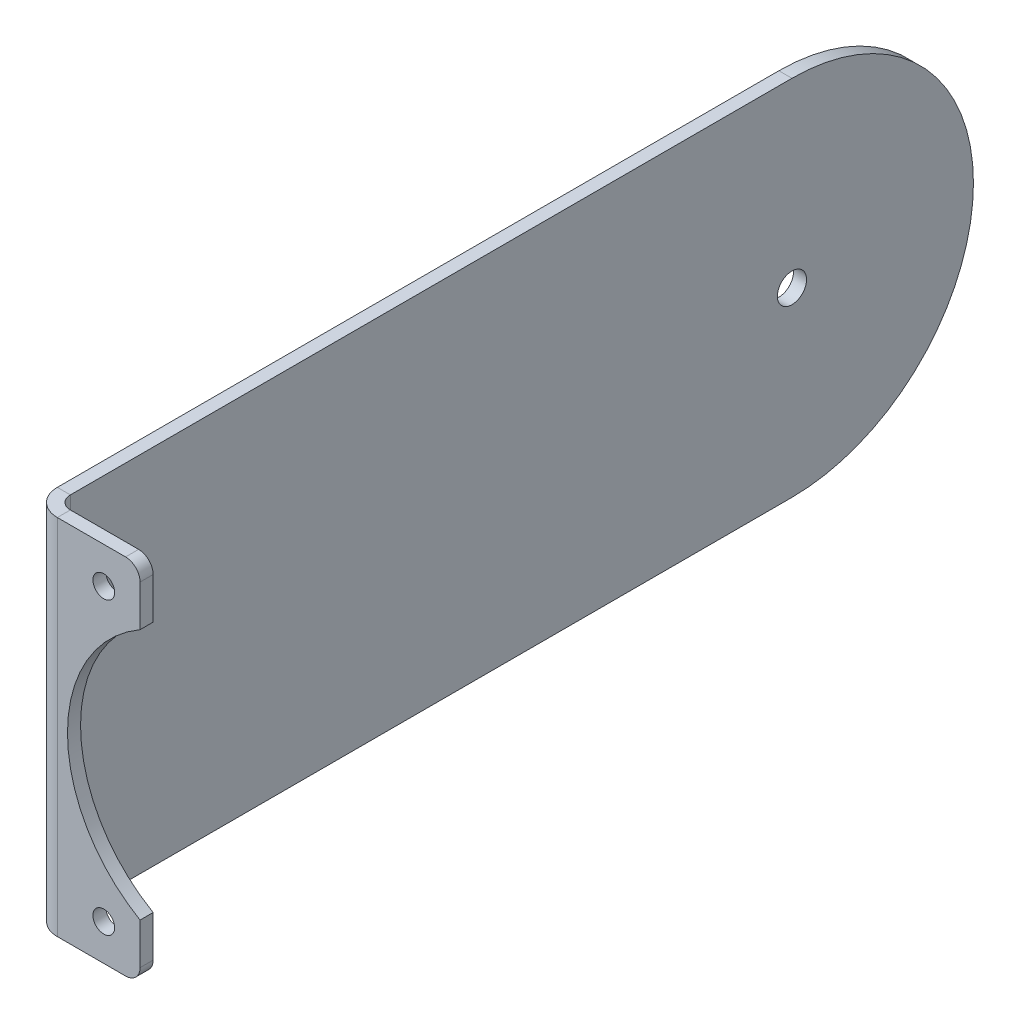
ISO-10303-21;
HEADER;
FILE_DESCRIPTION(('STEP AP214'),'2;1');
FILE_NAME('part.step','',(''),(''),'','','');
FILE_SCHEMA(('AUTOMOTIVE_DESIGN { 1 0 10303 214 1 1 1 1 }'));
ENDSEC;
DATA;
#1=APPLICATION_CONTEXT('core data for automotive mechanical design processes');
#2=APPLICATION_PROTOCOL_DEFINITION('international standard','automotive_design',2000,#1);
#3=PRODUCT_CONTEXT('',#1,'mechanical');
#4=PRODUCT('Part','Part','',(#3));
#5=PRODUCT_RELATED_PRODUCT_CATEGORY('part','',(#4));
#6=PRODUCT_DEFINITION_FORMATION('','',#4);
#7=PRODUCT_DEFINITION_CONTEXT('part definition',#1,'design');
#8=PRODUCT_DEFINITION('design','',#6,#7);
#9=PRODUCT_DEFINITION_SHAPE('','',#8);
#10=(LENGTH_UNIT() NAMED_UNIT(*) SI_UNIT(.MILLI.,.METRE.));
#11=(NAMED_UNIT(*) PLANE_ANGLE_UNIT() SI_UNIT($,.RADIAN.));
#12=(NAMED_UNIT(*) SI_UNIT($,.STERADIAN.) SOLID_ANGLE_UNIT());
#13=UNCERTAINTY_MEASURE_WITH_UNIT(LENGTH_MEASURE(1.E-05),#10,'distance_accuracy_value','');
#14=(GEOMETRIC_REPRESENTATION_CONTEXT(3) GLOBAL_UNCERTAINTY_ASSIGNED_CONTEXT((#13)) GLOBAL_UNIT_ASSIGNED_CONTEXT((#10,
#11,#12)) REPRESENTATION_CONTEXT('',''));
#15=CARTESIAN_POINT('',(0.,0.,0.));
#16=DIRECTION('',(0.,0.,1.));
#17=DIRECTION('',(1.,0.,0.));
#18=AXIS2_PLACEMENT_3D('',#15,#16,#17);
#19=CARTESIAN_POINT('',(-7.23900000000002,31.75,-81.28));
#20=DIRECTION('',(1.,0.,0.));
#21=DIRECTION('',(0.,0.,-1.));
#22=AXIS2_PLACEMENT_3D('',#19,#20,#21);
#23=PLANE('',#22);
#24=CARTESIAN_POINT('',(-7.23900000000001,0.,-49.53));
#25=DIRECTION('',(1.,0.,0.));
#26=DIRECTION('',(0.,0.,-1.));
#27=AXIS2_PLACEMENT_3D('',#24,#25,#26);
#28=CIRCLE('',#27,2.5527);
#29=CARTESIAN_POINT('',(-7.23900000000001,0.,-52.0827));
#30=VERTEX_POINT('',#29);
#31=EDGE_CURVE('E153',#30,#30,#28,.T.);
#32=ORIENTED_EDGE('',*,*,#31,.F.);
#33=EDGE_LOOP('',(#32));
#34=FACE_BOUND('',#33,.T.);
#35=DIRECTION('',(0.,0.,1.));
#36=VECTOR('',#35,1.);
#37=CARTESIAN_POINT('',(-7.23900000000002,-31.75,-81.28));
#38=LINE('',#37,#36);
#39=CARTESIAN_POINT('',(-7.23900000000001,-31.75,-49.53));
#40=VERTEX_POINT('',#39);
#41=CARTESIAN_POINT('',(-7.23900000000001,-31.75,76.708));
#42=VERTEX_POINT('',#41);
#43=EDGE_CURVE('E160',#40,#42,#38,.T.);
#44=ORIENTED_EDGE('',*,*,#43,.F.);
#45=CARTESIAN_POINT('',(-7.23900000000001,0.,-49.53));
#46=DIRECTION('',(1.,0.,0.));
#47=DIRECTION('',(0.,0.,-1.));
#48=AXIS2_PLACEMENT_3D('',#45,#46,#47);
#49=CIRCLE('',#48,31.75);
#50=CARTESIAN_POINT('',(-7.23900000000001,31.75,-49.53));
#51=VERTEX_POINT('',#50);
#52=EDGE_CURVE('E66',#51,#40,#49,.F.);
#53=ORIENTED_EDGE('',*,*,#52,.F.);
#54=DIRECTION('',(0.,0.,1.));
#55=VECTOR('',#54,1.);
#56=CARTESIAN_POINT('',(-7.23900000000002,31.75,-81.28));
#57=LINE('',#56,#55);
#58=CARTESIAN_POINT('',(-7.23900000000001,31.75,76.708));
#59=VERTEX_POINT('',#58);
#60=EDGE_CURVE('E265',#51,#59,#57,.T.);
#61=ORIENTED_EDGE('',*,*,#60,.T.);
#62=DIRECTION('',(0.,-1.,0.));
#63=VECTOR('',#62,1.);
#64=CARTESIAN_POINT('',(-7.23900000000001,31.75,76.708));
#65=LINE('',#64,#63);
#66=EDGE_CURVE('E175',#59,#42,#65,.T.);
#67=ORIENTED_EDGE('',*,*,#66,.T.);
#68=EDGE_LOOP('',(#44,#53,#61,#67));
#69=FACE_BOUND('',#68,.T.);
#70=ADVANCED_FACE('F50',(#34,#69),#23,.T.);
#71=CARTESIAN_POINT('',(-9.52500000000002,31.75,-81.28));
#72=DIRECTION('',(1.,0.,0.));
#73=DIRECTION('',(0.,0.,-1.));
#74=AXIS2_PLACEMENT_3D('',#71,#72,#73);
#75=PLANE('',#74);
#76=CARTESIAN_POINT('',(-9.52500000000001,0.,-49.53));
#77=DIRECTION('',(-1.,0.,0.));
#78=DIRECTION('',(0.,0.,1.));
#79=AXIS2_PLACEMENT_3D('',#76,#77,#78);
#80=CIRCLE('',#79,2.5527);
#81=CARTESIAN_POINT('',(-9.52500000000001,0.,-46.9773));
#82=VERTEX_POINT('',#81);
#83=EDGE_CURVE('E294',#82,#82,#80,.T.);
#84=ORIENTED_EDGE('',*,*,#83,.F.);
#85=EDGE_LOOP('',(#84));
#86=FACE_BOUND('',#85,.T.);
#87=DIRECTION('',(0.,0.,1.));
#88=VECTOR('',#87,1.);
#89=CARTESIAN_POINT('',(-9.52500000000002,31.75,-81.28));
#90=LINE('',#89,#88);
#91=CARTESIAN_POINT('',(-9.52500000000001,31.75,-49.53));
#92=VERTEX_POINT('',#91);
#93=CARTESIAN_POINT('',(-9.52500000000001,31.75,76.708));
#94=VERTEX_POINT('',#93);
#95=EDGE_CURVE('E151',#92,#94,#90,.T.);
#96=ORIENTED_EDGE('',*,*,#95,.F.);
#97=CARTESIAN_POINT('',(-9.52500000000001,0.,-49.53));
#98=DIRECTION('',(1.,0.,0.));
#99=DIRECTION('',(0.,0.,1.));
#100=AXIS2_PLACEMENT_3D('',#97,#98,#99);
#101=CIRCLE('',#100,31.75);
#102=CARTESIAN_POINT('',(-9.52500000000001,-31.75,-49.53));
#103=VERTEX_POINT('',#102);
#104=EDGE_CURVE('E140',#103,#92,#101,.T.);
#105=ORIENTED_EDGE('',*,*,#104,.F.);
#106=DIRECTION('',(0.,0.,1.));
#107=VECTOR('',#106,1.);
#108=CARTESIAN_POINT('',(-9.52500000000002,-31.75,-81.28));
#109=LINE('',#108,#107);
#110=CARTESIAN_POINT('',(-9.52500000000001,-31.75,76.708));
#111=VERTEX_POINT('',#110);
#112=EDGE_CURVE('E149',#103,#111,#109,.T.);
#113=ORIENTED_EDGE('',*,*,#112,.T.);
#114=DIRECTION('',(0.,-1.,0.));
#115=VECTOR('',#114,1.);
#116=CARTESIAN_POINT('',(-9.52500000000001,31.75,76.708));
#117=LINE('',#116,#115);
#118=EDGE_CURVE('E172',#94,#111,#117,.T.);
#119=ORIENTED_EDGE('',*,*,#118,.F.);
#120=EDGE_LOOP('',(#96,#105,#113,#119));
#121=FACE_BOUND('',#120,.T.);
#122=ADVANCED_FACE('F147',(#86,#121),#75,.F.);
#123=CARTESIAN_POINT('',(9.525,31.75,78.994));
#124=DIRECTION('',(1.,0.,0.));
#125=DIRECTION('',(0.,0.,-1.));
#126=AXIS2_PLACEMENT_3D('',#123,#124,#125);
#127=PLANE('',#126);
#128=DIRECTION('',(0.,-1.,0.));
#129=VECTOR('',#128,1.);
#130=CARTESIAN_POINT('',(9.525,31.75,78.994));
#131=LINE('',#130,#129);
#132=CARTESIAN_POINT('',(9.525,29.21,78.994));
#133=VERTEX_POINT('',#132);
#134=CARTESIAN_POINT('',(9.525,21.9970452561247,78.994));
#135=VERTEX_POINT('',#134);
#136=EDGE_CURVE('E182',#133,#135,#131,.T.);
#137=ORIENTED_EDGE('',*,*,#136,.F.);
#138=DIRECTION('',(0.,0.,1.));
#139=VECTOR('',#138,1.);
#140=CARTESIAN_POINT('',(9.525,29.21,78.994));
#141=LINE('',#140,#139);
#142=CARTESIAN_POINT('',(9.525,29.21,81.28));
#143=VERTEX_POINT('',#142);
#144=EDGE_CURVE('E198',#133,#143,#141,.T.);
#145=ORIENTED_EDGE('',*,*,#144,.T.);
#146=DIRECTION('',(0.,-1.,0.));
#147=VECTOR('',#146,1.);
#148=CARTESIAN_POINT('',(9.525,31.75,81.28));
#149=LINE('',#148,#147);
#150=CARTESIAN_POINT('',(9.525,21.9970452561247,81.28));
#151=VERTEX_POINT('',#150);
#152=EDGE_CURVE('E185',#143,#151,#149,.T.);
#153=ORIENTED_EDGE('',*,*,#152,.T.);
#154=DIRECTION('',(0.,0.,1.));
#155=VECTOR('',#154,1.);
#156=CARTESIAN_POINT('',(9.525,21.9970452561247,-81.28));
#157=LINE('',#156,#155);
#158=EDGE_CURVE('E236',#135,#151,#157,.T.);
#159=ORIENTED_EDGE('',*,*,#158,.F.);
#160=EDGE_LOOP('',(#137,#145,#153,#159));
#161=FACE_BOUND('',#160,.T.);
#162=ADVANCED_FACE('F282',(#161),#127,.T.);
#163=CARTESIAN_POINT('',(-9.52500000000001,31.75,76.708));
#164=DIRECTION('',(0.,1.,0.));
#165=DIRECTION('',(0.,0.,1.));
#166=AXIS2_PLACEMENT_3D('',#163,#164,#165);
#167=PLANE('',#166);
#168=DIRECTION('',(1.,0.,0.));
#169=VECTOR('',#168,1.);
#170=CARTESIAN_POINT('',(-9.52500000000001,31.75,76.708));
#171=LINE('',#170,#169);
#172=EDGE_CURVE('E192',#94,#59,#171,.T.);
#173=ORIENTED_EDGE('',*,*,#172,.F.);
#174=CARTESIAN_POINT('',(-4.95300000000001,31.75,76.708));
#175=DIRECTION('',(0.,-1.,0.));
#176=DIRECTION('',(0.,0.,-1.));
#177=AXIS2_PLACEMENT_3D('',#174,#175,#176);
#178=CIRCLE('',#177,4.572);
#179=CARTESIAN_POINT('',(-4.95300000000001,31.75,81.28));
#180=VERTEX_POINT('',#179);
#181=EDGE_CURVE('E173',#94,#180,#178,.F.);
#182=ORIENTED_EDGE('',*,*,#181,.T.);
#183=DIRECTION('',(0.,0.,1.));
#184=VECTOR('',#183,1.);
#185=CARTESIAN_POINT('',(-4.95300000000001,31.75,78.994));
#186=LINE('',#185,#184);
#187=CARTESIAN_POINT('',(-4.95300000000001,31.75,78.994));
#188=VERTEX_POINT('',#187);
#189=EDGE_CURVE('E190',#188,#180,#186,.T.);
#190=ORIENTED_EDGE('',*,*,#189,.F.);
#191=CARTESIAN_POINT('',(-4.95300000000001,31.75,76.708));
#192=DIRECTION('',(0.,1.,0.));
#193=DIRECTION('',(-1.,0.,0.));
#194=AXIS2_PLACEMENT_3D('',#191,#192,#193);
#195=CIRCLE('',#194,2.286);
#196=EDGE_CURVE('E255',#59,#188,#195,.T.);
#197=ORIENTED_EDGE('',*,*,#196,.F.);
#198=EDGE_LOOP('',(#173,#182,#190,#197));
#199=FACE_BOUND('',#198,.T.);
#200=ADVANCED_FACE('F273',(#199),#167,.T.);
#201=CARTESIAN_POINT('',(-4.95300000000001,31.75,78.994));
#202=DIRECTION('',(0.,1.,0.));
#203=DIRECTION('',(0.,0.,1.));
#204=AXIS2_PLACEMENT_3D('',#201,#202,#203);
#205=PLANE('',#204);
#206=DIRECTION('',(-1.,0.,0.));
#207=VECTOR('',#206,1.);
#208=CARTESIAN_POINT('',(9.525,31.75,-49.53));
#209=LINE('',#208,#207);
#210=EDGE_CURVE('E152',#51,#92,#209,.T.);
#211=ORIENTED_EDGE('',*,*,#210,.T.);
#212=ORIENTED_EDGE('',*,*,#95,.T.);
#213=ORIENTED_EDGE('',*,*,#172,.T.);
#214=ORIENTED_EDGE('',*,*,#60,.F.);
#215=EDGE_LOOP('',(#211,#212,#213,#214));
#216=FACE_BOUND('',#215,.T.);
#217=ADVANCED_FACE('F482',(#216),#205,.T.);
#218=CARTESIAN_POINT('',(-4.95300000000001,-31.75,81.28));
#219=DIRECTION('',(0.,-1.,0.));
#220=DIRECTION('',(0.,0.,-1.));
#221=AXIS2_PLACEMENT_3D('',#218,#219,#220);
#222=PLANE('',#221);
#223=DIRECTION('',(0.,0.,-1.));
#224=VECTOR('',#223,1.);
#225=CARTESIAN_POINT('',(-4.95300000000001,-31.75,81.28));
#226=LINE('',#225,#224);
#227=CARTESIAN_POINT('',(-4.95300000000001,-31.75,81.28));
#228=VERTEX_POINT('',#227);
#229=CARTESIAN_POINT('',(-4.95300000000001,-31.75,78.994));
#230=VERTEX_POINT('',#229);
#231=EDGE_CURVE('E188',#228,#230,#226,.T.);
#232=ORIENTED_EDGE('',*,*,#231,.F.);
#233=CARTESIAN_POINT('',(-4.95300000000001,-31.75,76.708));
#234=DIRECTION('',(0.,-1.,0.));
#235=DIRECTION('',(0.,0.,-1.));
#236=AXIS2_PLACEMENT_3D('',#233,#234,#235);
#237=CIRCLE('',#236,4.572);
#238=EDGE_CURVE('E159',#111,#228,#237,.F.);
#239=ORIENTED_EDGE('',*,*,#238,.F.);
#240=DIRECTION('',(-1.,0.,0.));
#241=VECTOR('',#240,1.);
#242=CARTESIAN_POINT('',(-7.23900000000001,-31.75,76.708));
#243=LINE('',#242,#241);
#244=EDGE_CURVE('E157',#42,#111,#243,.T.);
#245=ORIENTED_EDGE('',*,*,#244,.F.);
#246=CARTESIAN_POINT('',(-4.95300000000001,-31.75,76.708));
#247=DIRECTION('',(0.,1.,0.));
#248=DIRECTION('',(-1.,0.,0.));
#249=AXIS2_PLACEMENT_3D('',#246,#247,#248);
#250=CIRCLE('',#249,2.286);
#251=EDGE_CURVE('E165',#42,#230,#250,.T.);
#252=ORIENTED_EDGE('',*,*,#251,.T.);
#253=EDGE_LOOP('',(#232,#239,#245,#252));
#254=FACE_BOUND('',#253,.T.);
#255=ADVANCED_FACE('F247',(#254),#222,.T.);
#256=CARTESIAN_POINT('',(-7.23900000000001,-31.75,76.708));
#257=DIRECTION('',(0.,-1.,0.));
#258=DIRECTION('',(0.,0.,-1.));
#259=AXIS2_PLACEMENT_3D('',#256,#257,#258);
#260=PLANE('',#259);
#261=DIRECTION('',(-1.,0.,0.));
#262=VECTOR('',#261,1.);
#263=CARTESIAN_POINT('',(-9.52500000000001,-31.75,78.994));
#264=LINE('',#263,#262);
#265=CARTESIAN_POINT('',(6.98499999999999,-31.75,78.994));
#266=VERTEX_POINT('',#265);
#267=EDGE_CURVE('E230',#230,#266,#264,.F.);
#268=ORIENTED_EDGE('',*,*,#267,.T.);
#269=DIRECTION('',(0.,0.,1.));
#270=VECTOR('',#269,1.);
#271=CARTESIAN_POINT('',(6.98499999999999,-31.75,76.708));
#272=LINE('',#271,#270);
#273=CARTESIAN_POINT('',(6.98499999999999,-31.75,81.28));
#274=VERTEX_POINT('',#273);
#275=EDGE_CURVE('E210',#266,#274,#272,.T.);
#276=ORIENTED_EDGE('',*,*,#275,.T.);
#277=DIRECTION('',(1.,0.,0.));
#278=VECTOR('',#277,1.);
#279=CARTESIAN_POINT('',(-9.52500000000001,-31.75,81.28));
#280=LINE('',#279,#278);
#281=EDGE_CURVE('E229',#228,#274,#280,.T.);
#282=ORIENTED_EDGE('',*,*,#281,.F.);
#283=ORIENTED_EDGE('',*,*,#231,.T.);
#284=EDGE_LOOP('',(#268,#276,#282,#283));
#285=FACE_BOUND('',#284,.T.);
#286=ADVANCED_FACE('F228',(#285),#260,.T.);
#287=CARTESIAN_POINT('',(-9.52500000000001,31.75,81.28));
#288=DIRECTION('',(0.,0.,-1.));
#289=DIRECTION('',(-1.,0.,0.));
#290=AXIS2_PLACEMENT_3D('',#287,#288,#289);
#291=PLANE('',#290);
#292=CARTESIAN_POINT('',(3.17499999999999,25.4,81.28));
#293=DIRECTION('',(0.,0.,1.));
#294=DIRECTION('',(1.,0.,0.));
#295=AXIS2_PLACEMENT_3D('',#292,#293,#294);
#296=CIRCLE('',#295,1.89865);
#297=CARTESIAN_POINT('',(5.07364999999999,25.4,81.28));
#298=VERTEX_POINT('',#297);
#299=EDGE_CURVE('E303',#298,#298,#296,.T.);
#300=ORIENTED_EDGE('',*,*,#299,.F.);
#301=EDGE_LOOP('',(#300));
#302=FACE_BOUND('',#301,.T.);
#303=CARTESIAN_POINT('',(3.17499999999999,-25.4,81.28));
#304=DIRECTION('',(0.,0.,1.));
#305=DIRECTION('',(1.,0.,0.));
#306=AXIS2_PLACEMENT_3D('',#303,#304,#305);
#307=CIRCLE('',#306,1.89865);
#308=CARTESIAN_POINT('',(5.07364999999999,-25.4,81.28));
#309=VERTEX_POINT('',#308);
#310=EDGE_CURVE('E300',#309,#309,#307,.T.);
#311=ORIENTED_EDGE('',*,*,#310,.F.);
#312=EDGE_LOOP('',(#311));
#313=FACE_BOUND('',#312,.T.);
#314=ORIENTED_EDGE('',*,*,#152,.F.);
#315=CARTESIAN_POINT('',(6.98499999999999,29.21,81.28));
#316=DIRECTION('',(0.,0.,-1.));
#317=DIRECTION('',(-1.,0.,0.));
#318=AXIS2_PLACEMENT_3D('',#315,#316,#317);
#319=CIRCLE('',#318,2.54);
#320=CARTESIAN_POINT('',(6.98499999999999,31.75,81.28));
#321=VERTEX_POINT('',#320);
#322=EDGE_CURVE('E203',#143,#321,#319,.F.);
#323=ORIENTED_EDGE('',*,*,#322,.T.);
#324=DIRECTION('',(1.,0.,0.));
#325=VECTOR('',#324,1.);
#326=CARTESIAN_POINT('',(-9.52500000000001,31.75,81.28));
#327=LINE('',#326,#325);
#328=EDGE_CURVE('E163',#180,#321,#327,.T.);
#329=ORIENTED_EDGE('',*,*,#328,.F.);
#330=DIRECTION('',(0.,-1.,0.));
#331=VECTOR('',#330,1.);
#332=CARTESIAN_POINT('',(-4.95300000000001,31.75,81.28));
#333=LINE('',#332,#331);
#334=EDGE_CURVE('E169',#180,#228,#333,.T.);
#335=ORIENTED_EDGE('',*,*,#334,.T.);
#336=ORIENTED_EDGE('',*,*,#281,.T.);
#337=CARTESIAN_POINT('',(6.98499999999999,-29.21,81.28));
#338=DIRECTION('',(0.,0.,-1.));
#339=DIRECTION('',(-1.,0.,0.));
#340=AXIS2_PLACEMENT_3D('',#337,#338,#339);
#341=CIRCLE('',#340,2.54);
#342=CARTESIAN_POINT('',(9.525,-29.21,81.28));
#343=VERTEX_POINT('',#342);
#344=EDGE_CURVE('E201',#274,#343,#341,.F.);
#345=ORIENTED_EDGE('',*,*,#344,.T.);
#346=CARTESIAN_POINT('',(9.525,-21.9970452561247,81.28));
#347=VERTEX_POINT('',#346);
#348=EDGE_CURVE('E184',#347,#343,#149,.T.);
#349=ORIENTED_EDGE('',*,*,#348,.F.);
#350=CARTESIAN_POINT('',(22.225,0.,81.28));
#351=DIRECTION('',(0.,0.,1.));
#352=DIRECTION('',(1.,0.,0.));
#353=AXIS2_PLACEMENT_3D('',#350,#351,#352);
#354=CIRCLE('',#353,25.4);
#355=EDGE_CURVE('E286',#151,#347,#354,.T.);
#356=ORIENTED_EDGE('',*,*,#355,.F.);
#357=EDGE_LOOP('',(#314,#323,#329,#335,#336,#345,#349,#356));
#358=FACE_BOUND('',#357,.T.);
#359=ADVANCED_FACE('F233',(#302,#313,#358),#291,.F.);
#360=ORIENTED_EDGE('',*,*,#348,.T.);
#361=DIRECTION('',(0.,0.,1.));
#362=VECTOR('',#361,1.);
#363=CARTESIAN_POINT('',(9.525,-29.21,78.994));
#364=LINE('',#363,#362);
#365=CARTESIAN_POINT('',(9.525,-29.21,78.994));
#366=VERTEX_POINT('',#365);
#367=EDGE_CURVE('E59',#343,#366,#364,.F.);
#368=ORIENTED_EDGE('',*,*,#367,.T.);
#369=CARTESIAN_POINT('',(9.525,-21.9970452561247,78.994));
#370=VERTEX_POINT('',#369);
#371=EDGE_CURVE('E181',#370,#366,#131,.T.);
#372=ORIENTED_EDGE('',*,*,#371,.F.);
#373=DIRECTION('',(0.,0.,1.));
#374=VECTOR('',#373,1.);
#375=CARTESIAN_POINT('',(9.525,-21.9970452561247,-81.28));
#376=LINE('',#375,#374);
#377=EDGE_CURVE('E240',#347,#370,#376,.F.);
#378=ORIENTED_EDGE('',*,*,#377,.F.);
#379=EDGE_LOOP('',(#360,#368,#372,#378));
#380=FACE_BOUND('',#379,.T.);
#381=ADVANCED_FACE('F217',(#380),#127,.T.);
#382=CARTESIAN_POINT('',(-9.52500000000001,31.75,78.994));
#383=DIRECTION('',(0.,0.,-1.));
#384=DIRECTION('',(-1.,0.,0.));
#385=AXIS2_PLACEMENT_3D('',#382,#383,#384);
#386=PLANE('',#385);
#387=CARTESIAN_POINT('',(3.17499999999999,25.4,78.994));
#388=DIRECTION('',(0.,0.,-1.));
#389=DIRECTION('',(-1.,0.,0.));
#390=AXIS2_PLACEMENT_3D('',#387,#388,#389);
#391=CIRCLE('',#390,1.89864999999998);
#392=CARTESIAN_POINT('',(1.27635000000001,25.4,78.994));
#393=VERTEX_POINT('',#392);
#394=EDGE_CURVE('E54',#393,#393,#391,.T.);
#395=ORIENTED_EDGE('',*,*,#394,.F.);
#396=EDGE_LOOP('',(#395));
#397=FACE_BOUND('',#396,.T.);
#398=CARTESIAN_POINT('',(3.17499999999999,-25.4,78.994));
#399=DIRECTION('',(0.,0.,-1.));
#400=DIRECTION('',(-1.,0.,0.));
#401=AXIS2_PLACEMENT_3D('',#398,#399,#400);
#402=CIRCLE('',#401,1.89864999999998);
#403=CARTESIAN_POINT('',(1.27635000000001,-25.4,78.994));
#404=VERTEX_POINT('',#403);
#405=EDGE_CURVE('E297',#404,#404,#402,.T.);
#406=ORIENTED_EDGE('',*,*,#405,.F.);
#407=EDGE_LOOP('',(#406));
#408=FACE_BOUND('',#407,.T.);
#409=DIRECTION('',(-1.,0.,0.));
#410=VECTOR('',#409,1.);
#411=CARTESIAN_POINT('',(-9.52500000000001,31.75,78.994));
#412=LINE('',#411,#410);
#413=CARTESIAN_POINT('',(6.98499999999999,31.75,78.994));
#414=VERTEX_POINT('',#413);
#415=EDGE_CURVE('E257',#188,#414,#412,.F.);
#416=ORIENTED_EDGE('',*,*,#415,.T.);
#417=CARTESIAN_POINT('',(6.98499999999999,29.21,78.994));
#418=DIRECTION('',(0.,0.,-1.));
#419=DIRECTION('',(-1.,0.,0.));
#420=AXIS2_PLACEMENT_3D('',#417,#418,#419);
#421=CIRCLE('',#420,2.54);
#422=EDGE_CURVE('E208',#414,#133,#421,.T.);
#423=ORIENTED_EDGE('',*,*,#422,.T.);
#424=ORIENTED_EDGE('',*,*,#136,.T.);
#425=CARTESIAN_POINT('',(22.225,0.,78.994));
#426=DIRECTION('',(0.,0.,-1.));
#427=DIRECTION('',(-1.,0.,0.));
#428=AXIS2_PLACEMENT_3D('',#425,#426,#427);
#429=CIRCLE('',#428,25.4);
#430=EDGE_CURVE('E195',#370,#135,#429,.T.);
#431=ORIENTED_EDGE('',*,*,#430,.F.);
#432=ORIENTED_EDGE('',*,*,#371,.T.);
#433=CARTESIAN_POINT('',(6.98499999999999,-29.21,78.994));
#434=DIRECTION('',(0.,0.,-1.));
#435=DIRECTION('',(-1.,0.,0.));
#436=AXIS2_PLACEMENT_3D('',#433,#434,#435);
#437=CIRCLE('',#436,2.54);
#438=EDGE_CURVE('E73',#366,#266,#437,.T.);
#439=ORIENTED_EDGE('',*,*,#438,.T.);
#440=ORIENTED_EDGE('',*,*,#267,.F.);
#441=DIRECTION('',(0.,-1.,0.));
#442=VECTOR('',#441,1.);
#443=CARTESIAN_POINT('',(-4.95300000000001,31.75,78.994));
#444=LINE('',#443,#442);
#445=EDGE_CURVE('E178',#188,#230,#444,.T.);
#446=ORIENTED_EDGE('',*,*,#445,.F.);
#447=EDGE_LOOP('',(#416,#423,#424,#431,#432,#439,#440,#446));
#448=FACE_BOUND('',#447,.T.);
#449=ADVANCED_FACE('F223',(#397,#408,#448),#386,.T.);
#450=CARTESIAN_POINT('',(-4.95300000000001,31.75,76.708));
#451=DIRECTION('',(0.,-1.,0.));
#452=DIRECTION('',(0.,0.,-1.));
#453=AXIS2_PLACEMENT_3D('',#450,#451,#452);
#454=CYLINDRICAL_SURFACE('',#453,2.286);
#455=ORIENTED_EDGE('',*,*,#251,.F.);
#456=ORIENTED_EDGE('',*,*,#66,.F.);
#457=ORIENTED_EDGE('',*,*,#196,.T.);
#458=ORIENTED_EDGE('',*,*,#445,.T.);
#459=EDGE_LOOP('',(#455,#456,#457,#458));
#460=FACE_BOUND('',#459,.T.);
#461=ADVANCED_FACE('F251',(#460),#454,.F.);
#462=CARTESIAN_POINT('',(-4.95300000000001,31.75,76.708));
#463=DIRECTION('',(0.,-1.,0.));
#464=DIRECTION('',(0.,0.,-1.));
#465=AXIS2_PLACEMENT_3D('',#462,#463,#464);
#466=CYLINDRICAL_SURFACE('',#465,4.572);
#467=ORIENTED_EDGE('',*,*,#238,.T.);
#468=ORIENTED_EDGE('',*,*,#334,.F.);
#469=ORIENTED_EDGE('',*,*,#181,.F.);
#470=ORIENTED_EDGE('',*,*,#118,.T.);
#471=EDGE_LOOP('',(#467,#468,#469,#470));
#472=FACE_BOUND('',#471,.T.);
#473=ADVANCED_FACE('F275',(#472),#466,.T.);
#474=CARTESIAN_POINT('',(-4.95300000000001,31.75,76.708));
#475=DIRECTION('',(0.,1.,0.));
#476=DIRECTION('',(-1.,0.,0.));
#477=AXIS2_PLACEMENT_3D('',#474,#475,#476);
#478=PLANE('',#477);
#479=ORIENTED_EDGE('',*,*,#328,.T.);
#480=DIRECTION('',(0.,0.,1.));
#481=VECTOR('',#480,1.);
#482=CARTESIAN_POINT('',(6.98499999999999,31.75,76.708));
#483=LINE('',#482,#481);
#484=EDGE_CURVE('E205',#321,#414,#483,.F.);
#485=ORIENTED_EDGE('',*,*,#484,.T.);
#486=ORIENTED_EDGE('',*,*,#415,.F.);
#487=ORIENTED_EDGE('',*,*,#189,.T.);
#488=EDGE_LOOP('',(#479,#485,#486,#487));
#489=FACE_BOUND('',#488,.T.);
#490=ADVANCED_FACE('F261',(#489),#478,.T.);
#491=CARTESIAN_POINT('',(-4.95300000000001,-31.75,76.708));
#492=DIRECTION('',(0.,1.,0.));
#493=DIRECTION('',(-1.,0.,0.));
#494=AXIS2_PLACEMENT_3D('',#491,#492,#493);
#495=PLANE('',#494);
#496=ORIENTED_EDGE('',*,*,#112,.F.);
#497=DIRECTION('',(-1.,0.,0.));
#498=VECTOR('',#497,1.);
#499=CARTESIAN_POINT('',(9.525,-31.75,-49.53));
#500=LINE('',#499,#498);
#501=EDGE_CURVE('E11',#103,#40,#500,.F.);
#502=ORIENTED_EDGE('',*,*,#501,.T.);
#503=ORIENTED_EDGE('',*,*,#43,.T.);
#504=ORIENTED_EDGE('',*,*,#244,.T.);
#505=EDGE_LOOP('',(#496,#502,#503,#504));
#506=FACE_BOUND('',#505,.T.);
#507=ADVANCED_FACE('F155',(#506),#495,.F.);
#508=CARTESIAN_POINT('',(22.225,0.,-81.28));
#509=DIRECTION('',(0.,0.,1.));
#510=DIRECTION('',(1.,0.,0.));
#511=AXIS2_PLACEMENT_3D('',#508,#509,#510);
#512=CYLINDRICAL_SURFACE('',#511,25.4);
#513=ORIENTED_EDGE('',*,*,#158,.T.);
#514=ORIENTED_EDGE('',*,*,#355,.T.);
#515=ORIENTED_EDGE('',*,*,#377,.T.);
#516=ORIENTED_EDGE('',*,*,#430,.T.);
#517=EDGE_LOOP('',(#513,#514,#515,#516));
#518=FACE_BOUND('',#517,.T.);
#519=ADVANCED_FACE('F285',(#518),#512,.F.);
#520=CARTESIAN_POINT('',(6.98499999999999,29.21,78.994));
#521=DIRECTION('',(0.,0.,1.));
#522=DIRECTION('',(1.,0.,0.));
#523=AXIS2_PLACEMENT_3D('',#520,#521,#522);
#524=CYLINDRICAL_SURFACE('',#523,2.54);
#525=ORIENTED_EDGE('',*,*,#422,.F.);
#526=ORIENTED_EDGE('',*,*,#484,.F.);
#527=ORIENTED_EDGE('',*,*,#322,.F.);
#528=ORIENTED_EDGE('',*,*,#144,.F.);
#529=EDGE_LOOP('',(#525,#526,#527,#528));
#530=FACE_BOUND('',#529,.T.);
#531=ADVANCED_FACE('F277',(#530),#524,.T.);
#532=CARTESIAN_POINT('',(6.98499999999999,-29.21,76.708));
#533=DIRECTION('',(0.,0.,1.));
#534=DIRECTION('',(1.,0.,0.));
#535=AXIS2_PLACEMENT_3D('',#532,#533,#534);
#536=CYLINDRICAL_SURFACE('',#535,2.54);
#537=ORIENTED_EDGE('',*,*,#438,.F.);
#538=ORIENTED_EDGE('',*,*,#367,.F.);
#539=ORIENTED_EDGE('',*,*,#344,.F.);
#540=ORIENTED_EDGE('',*,*,#275,.F.);
#541=EDGE_LOOP('',(#537,#538,#539,#540));
#542=FACE_BOUND('',#541,.T.);
#543=ADVANCED_FACE('F52',(#542),#536,.T.);
#544=CARTESIAN_POINT('',(9.525,0.,-49.53));
#545=DIRECTION('',(-1.,0.,0.));
#546=DIRECTION('',(0.,0.,1.));
#547=AXIS2_PLACEMENT_3D('',#544,#545,#546);
#548=CYLINDRICAL_SURFACE('',#547,31.75);
#549=ORIENTED_EDGE('',*,*,#52,.T.);
#550=ORIENTED_EDGE('',*,*,#501,.F.);
#551=ORIENTED_EDGE('',*,*,#104,.T.);
#552=ORIENTED_EDGE('',*,*,#210,.F.);
#553=EDGE_LOOP('',(#549,#550,#551,#552));
#554=FACE_BOUND('',#553,.T.);
#555=ADVANCED_FACE('F139',(#554),#548,.T.);
#556=CARTESIAN_POINT('',(-9.52500000000001,0.,-49.53));
#557=DIRECTION('',(-1.,0.,0.));
#558=DIRECTION('',(0.,0.,1.));
#559=AXIS2_PLACEMENT_3D('',#556,#557,#558);
#560=CYLINDRICAL_SURFACE('',#559,2.5527);
#561=ORIENTED_EDGE('',*,*,#31,.T.);
#562=EDGE_LOOP('',(#561));
#563=FACE_BOUND('',#562,.T.);
#564=ORIENTED_EDGE('',*,*,#83,.T.);
#565=EDGE_LOOP('',(#564));
#566=FACE_BOUND('',#565,.T.);
#567=ADVANCED_FACE('F320',(#563,#566),#560,.F.);
#568=CARTESIAN_POINT('',(3.17499999999999,-25.4,81.28));
#569=DIRECTION('',(0.,0.,1.));
#570=DIRECTION('',(1.,0.,0.));
#571=AXIS2_PLACEMENT_3D('',#568,#569,#570);
#572=CYLINDRICAL_SURFACE('',#571,1.89864999999998);
#573=ORIENTED_EDGE('',*,*,#405,.T.);
#574=EDGE_LOOP('',(#573));
#575=FACE_BOUND('',#574,.T.);
#576=ORIENTED_EDGE('',*,*,#310,.T.);
#577=EDGE_LOOP('',(#576));
#578=FACE_BOUND('',#577,.T.);
#579=ADVANCED_FACE('F317',(#575,#578),#572,.F.);
#580=CARTESIAN_POINT('',(3.17499999999999,25.4,81.28));
#581=DIRECTION('',(0.,0.,1.));
#582=DIRECTION('',(1.,0.,0.));
#583=AXIS2_PLACEMENT_3D('',#580,#581,#582);
#584=CYLINDRICAL_SURFACE('',#583,1.89864999999998);
#585=ORIENTED_EDGE('',*,*,#394,.T.);
#586=EDGE_LOOP('',(#585));
#587=FACE_BOUND('',#586,.T.);
#588=ORIENTED_EDGE('',*,*,#299,.T.);
#589=EDGE_LOOP('',(#588));
#590=FACE_BOUND('',#589,.T.);
#591=ADVANCED_FACE('F310',(#587,#590),#584,.F.);
#592=CLOSED_SHELL('',(#70,#122,#162,#200,#217,#255,#286,#359,#381,#449,#461,#473,#490,#507,#519,
#531,#543,#555,#567,#579,#591));
#593=MANIFOLD_SOLID_BREP('B2',#592);
#594=ADVANCED_BREP_SHAPE_REPRESENTATION('',(#18,#593),#14);
#595=SHAPE_DEFINITION_REPRESENTATION(#9,#594);
ENDSEC;
END-ISO-10303-21;
